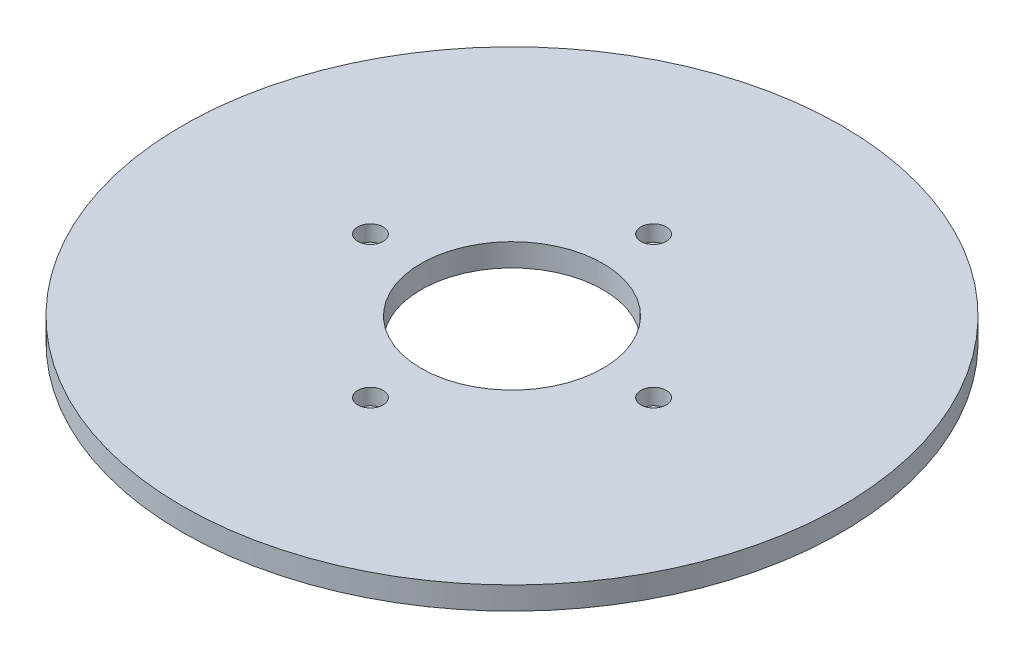
ISO-10303-21;
HEADER;
FILE_DESCRIPTION(('STEP AP214'),'2;1');
FILE_NAME('part.step','',(''),(''),'','','');
FILE_SCHEMA(('AUTOMOTIVE_DESIGN { 1 0 10303 214 1 1 1 1 }'));
ENDSEC;
DATA;
#1=APPLICATION_CONTEXT('core data for automotive mechanical design processes');
#2=APPLICATION_PROTOCOL_DEFINITION('international standard','automotive_design',2000,#1);
#3=PRODUCT_CONTEXT('',#1,'mechanical');
#4=PRODUCT('Part','Part','',(#3));
#5=PRODUCT_RELATED_PRODUCT_CATEGORY('part','',(#4));
#6=PRODUCT_DEFINITION_FORMATION('','',#4);
#7=PRODUCT_DEFINITION_CONTEXT('part definition',#1,'design');
#8=PRODUCT_DEFINITION('design','',#6,#7);
#9=PRODUCT_DEFINITION_SHAPE('','',#8);
#10=(LENGTH_UNIT() NAMED_UNIT(*) SI_UNIT(.MILLI.,.METRE.));
#11=(NAMED_UNIT(*) PLANE_ANGLE_UNIT() SI_UNIT($,.RADIAN.));
#12=(NAMED_UNIT(*) SI_UNIT($,.STERADIAN.) SOLID_ANGLE_UNIT());
#13=UNCERTAINTY_MEASURE_WITH_UNIT(LENGTH_MEASURE(1.E-05),#10,'distance_accuracy_value','');
#14=(GEOMETRIC_REPRESENTATION_CONTEXT(3) GLOBAL_UNCERTAINTY_ASSIGNED_CONTEXT((#13)) GLOBAL_UNIT_ASSIGNED_CONTEXT((#10,
#11,#12)) REPRESENTATION_CONTEXT('',''));
#15=CARTESIAN_POINT('',(0.,0.,0.));
#16=DIRECTION('',(0.,0.,1.));
#17=DIRECTION('',(1.,0.,0.));
#18=AXIS2_PLACEMENT_3D('',#15,#16,#17);
#19=CARTESIAN_POINT('',(0.,5.,0.));
#20=DIRECTION('',(0.,-1.,0.));
#21=DIRECTION('',(0.,0.,-1.));
#22=AXIS2_PLACEMENT_3D('',#19,#20,#21);
#23=CYLINDRICAL_SURFACE('',#22,72.5);
#24=CARTESIAN_POINT('',(0.,5.,0.));
#25=DIRECTION('',(0.,1.,0.));
#26=DIRECTION('',(0.,0.,1.));
#27=AXIS2_PLACEMENT_3D('',#24,#25,#26);
#28=CIRCLE('',#27,72.5);
#29=CARTESIAN_POINT('',(0.,5.,72.5));
#30=VERTEX_POINT('',#29);
#31=EDGE_CURVE('E10',#30,#30,#28,.T.);
#32=ORIENTED_EDGE('',*,*,#31,.F.);
#33=EDGE_LOOP('',(#32));
#34=FACE_BOUND('',#33,.T.);
#35=CARTESIAN_POINT('',(0.,0.,0.));
#36=DIRECTION('',(0.,1.,0.));
#37=DIRECTION('',(0.,0.,1.));
#38=AXIS2_PLACEMENT_3D('',#35,#36,#37);
#39=CIRCLE('',#38,72.5);
#40=CARTESIAN_POINT('',(0.,0.,72.5));
#41=VERTEX_POINT('',#40);
#42=EDGE_CURVE('E37',#41,#41,#39,.T.);
#43=ORIENTED_EDGE('',*,*,#42,.T.);
#44=EDGE_LOOP('',(#43));
#45=FACE_BOUND('',#44,.T.);
#46=ADVANCED_FACE('F40',(#34,#45),#23,.T.);
#47=CARTESIAN_POINT('',(0.,5.,0.));
#48=DIRECTION('',(0.,1.,0.));
#49=DIRECTION('',(0.,0.,1.));
#50=AXIS2_PLACEMENT_3D('',#47,#48,#49);
#51=PLANE('',#50);
#52=CARTESIAN_POINT('',(1.08742094683296E-13,5.,31.1449737604287));
#53=DIRECTION('',(0.,1.,0.));
#54=DIRECTION('',(1.,0.,0.));
#55=AXIS2_PLACEMENT_3D('',#52,#53,#54);
#56=CIRCLE('',#55,2.78970544607042);
#57=CARTESIAN_POINT('',(2.78970544607053,5.,31.1449737604287));
#58=VERTEX_POINT('',#57);
#59=EDGE_CURVE('E71',#58,#58,#56,.T.);
#60=ORIENTED_EDGE('',*,*,#59,.F.);
#61=EDGE_LOOP('',(#60));
#62=FACE_BOUND('',#61,.T.);
#63=CARTESIAN_POINT('',(31.1449737604287,5.,0.));
#64=DIRECTION('',(0.,1.,0.));
#65=DIRECTION('',(0.,0.,-1.));
#66=AXIS2_PLACEMENT_3D('',#63,#64,#65);
#67=CIRCLE('',#66,2.78970544607042);
#68=CARTESIAN_POINT('',(31.1449737604287,5.,-2.78970544607042));
#69=VERTEX_POINT('',#68);
#70=EDGE_CURVE('E70',#69,#69,#67,.T.);
#71=ORIENTED_EDGE('',*,*,#70,.F.);
#72=EDGE_LOOP('',(#71));
#73=FACE_BOUND('',#72,.T.);
#74=CARTESIAN_POINT('',(-3.26226284049887E-13,5.,-31.1449737604287));
#75=DIRECTION('',(0.,1.,0.));
#76=DIRECTION('',(-1.,0.,0.));
#77=AXIS2_PLACEMENT_3D('',#74,#75,#76);
#78=CIRCLE('',#77,2.78970544607042);
#79=CARTESIAN_POINT('',(-2.78970544607075,5.,-31.1449737604287));
#80=VERTEX_POINT('',#79);
#81=EDGE_CURVE('E61',#80,#80,#78,.T.);
#82=ORIENTED_EDGE('',*,*,#81,.F.);
#83=EDGE_LOOP('',(#82));
#84=FACE_BOUND('',#83,.T.);
#85=CARTESIAN_POINT('',(-31.1449737604287,5.,0.));
#86=DIRECTION('',(0.,1.,0.));
#87=DIRECTION('',(0.,0.,1.));
#88=AXIS2_PLACEMENT_3D('',#85,#86,#87);
#89=CIRCLE('',#88,2.78970544607042);
#90=CARTESIAN_POINT('',(-31.1449737604287,5.,2.78970544607042));
#91=VERTEX_POINT('',#90);
#92=EDGE_CURVE('E54',#91,#91,#89,.T.);
#93=ORIENTED_EDGE('',*,*,#92,.F.);
#94=EDGE_LOOP('',(#93));
#95=FACE_BOUND('',#94,.T.);
#96=CARTESIAN_POINT('',(0.,5.,0.));
#97=DIRECTION('',(0.,1.,0.));
#98=DIRECTION('',(0.,0.,1.));
#99=AXIS2_PLACEMENT_3D('',#96,#97,#98);
#100=CIRCLE('',#99,20.);
#101=CARTESIAN_POINT('',(0.,5.,20.));
#102=VERTEX_POINT('',#101);
#103=EDGE_CURVE('E50',#102,#102,#100,.T.);
#104=ORIENTED_EDGE('',*,*,#103,.F.);
#105=EDGE_LOOP('',(#104));
#106=FACE_BOUND('',#105,.T.);
#107=ORIENTED_EDGE('',*,*,#31,.T.);
#108=EDGE_LOOP('',(#107));
#109=FACE_BOUND('',#108,.T.);
#110=ADVANCED_FACE('F86',(#62,#73,#84,#95,#106,#109),#51,.T.);
#111=CARTESIAN_POINT('',(0.,0.,0.));
#112=DIRECTION('',(0.,1.,0.));
#113=DIRECTION('',(0.,0.,1.));
#114=AXIS2_PLACEMENT_3D('',#111,#112,#113);
#115=PLANE('',#114);
#116=CARTESIAN_POINT('',(0.,0.,0.));
#117=DIRECTION('',(0.,1.,0.));
#118=DIRECTION('',(0.,0.,1.));
#119=AXIS2_PLACEMENT_3D('',#116,#117,#118);
#120=CIRCLE('',#119,20.);
#121=CARTESIAN_POINT('',(0.,0.,20.));
#122=VERTEX_POINT('',#121);
#123=EDGE_CURVE('E47',#122,#122,#120,.T.);
#124=ORIENTED_EDGE('',*,*,#123,.T.);
#125=EDGE_LOOP('',(#124));
#126=FACE_BOUND('',#125,.T.);
#127=ORIENTED_EDGE('',*,*,#42,.F.);
#128=EDGE_LOOP('',(#127));
#129=FACE_BOUND('',#128,.T.);
#130=ADVANCED_FACE('F93',(#126,#129),#115,.F.);
#131=CARTESIAN_POINT('',(0.,5.,0.));
#132=DIRECTION('',(0.,-1.,0.));
#133=DIRECTION('',(0.,0.,-1.));
#134=AXIS2_PLACEMENT_3D('',#131,#132,#133);
#135=CYLINDRICAL_SURFACE('',#134,20.);
#136=ORIENTED_EDGE('',*,*,#103,.T.);
#137=EDGE_LOOP('',(#136));
#138=FACE_BOUND('',#137,.T.);
#139=ORIENTED_EDGE('',*,*,#123,.F.);
#140=EDGE_LOOP('',(#139));
#141=FACE_BOUND('',#140,.T.);
#142=ADVANCED_FACE('F101',(#138,#141),#135,.F.);
#143=CARTESIAN_POINT('',(-31.1449737604287,1.48611373831076,0.));
#144=DIRECTION('',(0.,1.,0.));
#145=DIRECTION('',(0.,0.,1.));
#146=AXIS2_PLACEMENT_3D('',#143,#144,#145);
#147=CYLINDRICAL_SURFACE('',#146,2.78970544607042);
#148=CARTESIAN_POINT('',(-31.1449737604287,1.48611373831076,0.));
#149=DIRECTION('',(0.,1.,0.));
#150=DIRECTION('',(0.,0.,1.));
#151=AXIS2_PLACEMENT_3D('',#148,#149,#150);
#152=CIRCLE('',#151,2.78970544607042);
#153=CARTESIAN_POINT('',(-31.1449737604287,1.48611373831076,2.78970544607042));
#154=VERTEX_POINT('',#153);
#155=EDGE_CURVE('E55',#154,#154,#152,.T.);
#156=ORIENTED_EDGE('',*,*,#155,.F.);
#157=EDGE_LOOP('',(#156));
#158=FACE_BOUND('',#157,.T.);
#159=ORIENTED_EDGE('',*,*,#92,.T.);
#160=EDGE_LOOP('',(#159));
#161=FACE_BOUND('',#160,.T.);
#162=ADVANCED_FACE('F102',(#158,#161),#147,.F.);
#163=CARTESIAN_POINT('',(-31.1449737604287,1.48611373831076,0.));
#164=DIRECTION('',(0.,1.,0.));
#165=DIRECTION('',(0.,0.,1.));
#166=AXIS2_PLACEMENT_3D('',#163,#164,#165);
#167=PLANE('',#166);
#168=ORIENTED_EDGE('',*,*,#155,.T.);
#169=EDGE_LOOP('',(#168));
#170=FACE_BOUND('',#169,.T.);
#171=ADVANCED_FACE('F133',(#170),#167,.T.);
#172=CARTESIAN_POINT('',(-3.26226284049887E-13,1.48611373831076,-31.1449737604287));
#173=DIRECTION('',(0.,1.,0.));
#174=DIRECTION('',(0.,0.,1.));
#175=AXIS2_PLACEMENT_3D('',#172,#173,#174);
#176=CYLINDRICAL_SURFACE('',#175,2.78970544607042);
#177=CARTESIAN_POINT('',(-3.26226284049887E-13,1.48611373831076,-31.1449737604287));
#178=DIRECTION('',(0.,1.,0.));
#179=DIRECTION('',(-1.,0.,0.));
#180=AXIS2_PLACEMENT_3D('',#177,#178,#179);
#181=CIRCLE('',#180,2.78970544607042);
#182=CARTESIAN_POINT('',(-2.78970544607075,1.48611373831076,-31.1449737604287));
#183=VERTEX_POINT('',#182);
#184=EDGE_CURVE('E63',#183,#183,#181,.T.);
#185=ORIENTED_EDGE('',*,*,#184,.F.);
#186=EDGE_LOOP('',(#185));
#187=FACE_BOUND('',#186,.T.);
#188=ORIENTED_EDGE('',*,*,#81,.T.);
#189=EDGE_LOOP('',(#188));
#190=FACE_BOUND('',#189,.T.);
#191=ADVANCED_FACE('F142',(#187,#190),#176,.F.);
#192=CARTESIAN_POINT('',(-3.26226284049887E-13,1.48611373831076,-31.1449737604287));
#193=DIRECTION('',(0.,1.,0.));
#194=DIRECTION('',(-1.,0.,0.));
#195=AXIS2_PLACEMENT_3D('',#192,#193,#194);
#196=PLANE('',#195);
#197=ORIENTED_EDGE('',*,*,#184,.T.);
#198=EDGE_LOOP('',(#197));
#199=FACE_BOUND('',#198,.T.);
#200=ADVANCED_FACE('F156',(#199),#196,.T.);
#201=CARTESIAN_POINT('',(31.1449737604287,1.48611373831076,0.));
#202=DIRECTION('',(0.,1.,0.));
#203=DIRECTION('',(0.,0.,1.));
#204=AXIS2_PLACEMENT_3D('',#201,#202,#203);
#205=CYLINDRICAL_SURFACE('',#204,2.78970544607042);
#206=CARTESIAN_POINT('',(31.1449737604287,1.48611373831076,0.));
#207=DIRECTION('',(0.,1.,0.));
#208=DIRECTION('',(0.,0.,-1.));
#209=AXIS2_PLACEMENT_3D('',#206,#207,#208);
#210=CIRCLE('',#209,2.78970544607042);
#211=CARTESIAN_POINT('',(31.1449737604287,1.48611373831076,-2.78970544607042));
#212=VERTEX_POINT('',#211);
#213=EDGE_CURVE('E69',#212,#212,#210,.T.);
#214=ORIENTED_EDGE('',*,*,#213,.F.);
#215=EDGE_LOOP('',(#214));
#216=FACE_BOUND('',#215,.T.);
#217=ORIENTED_EDGE('',*,*,#70,.T.);
#218=EDGE_LOOP('',(#217));
#219=FACE_BOUND('',#218,.T.);
#220=ADVANCED_FACE('F164',(#216,#219),#205,.F.);
#221=CARTESIAN_POINT('',(31.1449737604287,1.48611373831076,0.));
#222=DIRECTION('',(0.,1.,0.));
#223=DIRECTION('',(0.,0.,-1.));
#224=AXIS2_PLACEMENT_3D('',#221,#222,#223);
#225=PLANE('',#224);
#226=ORIENTED_EDGE('',*,*,#213,.T.);
#227=EDGE_LOOP('',(#226));
#228=FACE_BOUND('',#227,.T.);
#229=ADVANCED_FACE('F83',(#228),#225,.T.);
#230=CARTESIAN_POINT('',(1.08742094683296E-13,1.48611373831076,31.1449737604287));
#231=DIRECTION('',(0.,1.,0.));
#232=DIRECTION('',(0.,0.,1.));
#233=AXIS2_PLACEMENT_3D('',#230,#231,#232);
#234=CYLINDRICAL_SURFACE('',#233,2.78970544607042);
#235=CARTESIAN_POINT('',(1.08742094683296E-13,1.48611373831076,31.1449737604287));
#236=DIRECTION('',(0.,1.,0.));
#237=DIRECTION('',(1.,0.,0.));
#238=AXIS2_PLACEMENT_3D('',#235,#236,#237);
#239=CIRCLE('',#238,2.78970544607042);
#240=CARTESIAN_POINT('',(2.78970544607053,1.48611373831076,31.1449737604287));
#241=VERTEX_POINT('',#240);
#242=EDGE_CURVE('E59',#241,#241,#239,.T.);
#243=ORIENTED_EDGE('',*,*,#242,.F.);
#244=EDGE_LOOP('',(#243));
#245=FACE_BOUND('',#244,.T.);
#246=ORIENTED_EDGE('',*,*,#59,.T.);
#247=EDGE_LOOP('',(#246));
#248=FACE_BOUND('',#247,.T.);
#249=ADVANCED_FACE('F81',(#245,#248),#234,.F.);
#250=CARTESIAN_POINT('',(1.08742094683296E-13,1.48611373831076,31.1449737604287));
#251=DIRECTION('',(0.,1.,0.));
#252=DIRECTION('',(1.,0.,0.));
#253=AXIS2_PLACEMENT_3D('',#250,#251,#252);
#254=PLANE('',#253);
#255=ORIENTED_EDGE('',*,*,#242,.T.);
#256=EDGE_LOOP('',(#255));
#257=FACE_BOUND('',#256,.T.);
#258=ADVANCED_FACE('F78',(#257),#254,.T.);
#259=CLOSED_SHELL('',(#46,#110,#130,#142,#162,#171,#191,#200,#220,#229,#249,#258));
#260=MANIFOLD_SOLID_BREP('B2',#259);
#261=ADVANCED_BREP_SHAPE_REPRESENTATION('',(#18,#260),#14);
#262=SHAPE_DEFINITION_REPRESENTATION(#9,#261);
ENDSEC;
END-ISO-10303-21;
